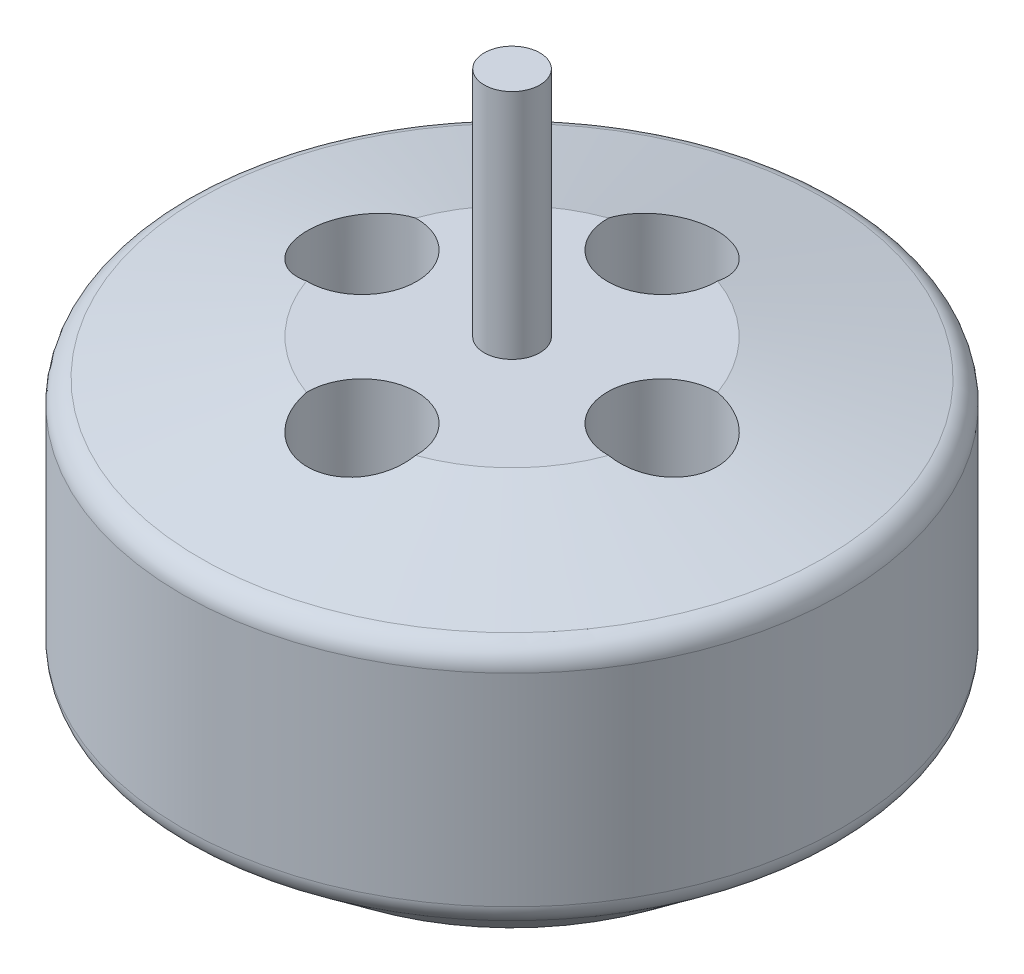
ISO-10303-21;
HEADER;
FILE_DESCRIPTION(('STEP AP214'),'2;1');
FILE_NAME('part.step','',(''),(''),'','','');
FILE_SCHEMA(('AUTOMOTIVE_DESIGN { 1 0 10303 214 1 1 1 1 }'));
ENDSEC;
DATA;
#1=APPLICATION_CONTEXT('core data for automotive mechanical design processes');
#2=APPLICATION_PROTOCOL_DEFINITION('international standard','automotive_design',2000,#1);
#3=PRODUCT_CONTEXT('',#1,'mechanical');
#4=PRODUCT('Part','Part','',(#3));
#5=PRODUCT_RELATED_PRODUCT_CATEGORY('part','',(#4));
#6=PRODUCT_DEFINITION_FORMATION('','',#4);
#7=PRODUCT_DEFINITION_CONTEXT('part definition',#1,'design');
#8=PRODUCT_DEFINITION('design','',#6,#7);
#9=PRODUCT_DEFINITION_SHAPE('','',#8);
#10=(LENGTH_UNIT() NAMED_UNIT(*) SI_UNIT(.MILLI.,.METRE.));
#11=(NAMED_UNIT(*) PLANE_ANGLE_UNIT() SI_UNIT($,.RADIAN.));
#12=(NAMED_UNIT(*) SI_UNIT($,.STERADIAN.) SOLID_ANGLE_UNIT());
#13=UNCERTAINTY_MEASURE_WITH_UNIT(LENGTH_MEASURE(1.E-05),#10,'distance_accuracy_value','');
#14=(GEOMETRIC_REPRESENTATION_CONTEXT(3) GLOBAL_UNCERTAINTY_ASSIGNED_CONTEXT((#13)) GLOBAL_UNIT_ASSIGNED_CONTEXT((#10,
#11,#12)) REPRESENTATION_CONTEXT('',''));
#15=CARTESIAN_POINT('',(0.,0.,0.));
#16=DIRECTION('',(0.,0.,1.));
#17=DIRECTION('',(1.,0.,0.));
#18=AXIS2_PLACEMENT_3D('',#15,#16,#17);
#19=CARTESIAN_POINT('',(-1.2,9.23124075479543,0.));
#20=DIRECTION('',(0.,-1.,0.));
#21=DIRECTION('',(-1.,0.,0.));
#22=AXIS2_PLACEMENT_3D('',#19,#20,#21);
#23=PLANE('',#22);
#24=CARTESIAN_POINT('',(0.,9.23124075479543,0.));
#25=DIRECTION('',(0.,-1.,0.));
#26=DIRECTION('',(1.,0.,0.));
#27=AXIS2_PLACEMENT_3D('',#24,#25,#26);
#28=CIRCLE('',#27,1.2);
#29=CARTESIAN_POINT('',(1.2,9.23124075479543,0.));
#30=VERTEX_POINT('',#29);
#31=EDGE_CURVE('E217',#30,#30,#28,.T.);
#32=ORIENTED_EDGE('',*,*,#31,.F.);
#33=EDGE_LOOP('',(#32));
#34=FACE_BOUND('',#33,.T.);
#35=ADVANCED_FACE('F37',(#34),#23,.F.);
#36=CARTESIAN_POINT('',(0.,-15.7687592452046,0.));
#37=DIRECTION('',(0.,1.,0.));
#38=DIRECTION('',(1.,0.,0.));
#39=AXIS2_PLACEMENT_3D('',#36,#37,#38);
#40=PLANE('',#39);
#41=CARTESIAN_POINT('',(0.,-15.7687592452046,0.));
#42=DIRECTION('',(0.,-1.,0.));
#43=DIRECTION('',(1.,0.,0.));
#44=AXIS2_PLACEMENT_3D('',#41,#42,#43);
#45=CIRCLE('',#44,10.);
#46=CARTESIAN_POINT('',(10.,-15.7687592452046,0.));
#47=VERTEX_POINT('',#46);
#48=EDGE_CURVE('E101',#47,#47,#45,.T.);
#49=ORIENTED_EDGE('',*,*,#48,.T.);
#50=EDGE_LOOP('',(#49));
#51=FACE_BOUND('',#50,.T.);
#52=ADVANCED_FACE('F124',(#51),#40,.F.);
#53=CARTESIAN_POINT('',(0.,-15.7687592452046,0.));
#54=DIRECTION('',(0.,1.,0.));
#55=DIRECTION('',(1.,0.,0.));
#56=AXIS2_PLACEMENT_3D('',#53,#54,#55);
#57=CONICAL_SURFACE('',#56,10.,0.91044247390561);
#58=CARTESIAN_POINT('',(0.,-12.79594785704,0.));
#59=DIRECTION('',(0.,1.,0.));
#60=DIRECTION('',(-1.,0.,0.));
#61=AXIS2_PLACEMENT_3D('',#58,#59,#60);
#62=CIRCLE('',#61,13.8276275638373);
#63=CARTESIAN_POINT('',(-13.8276275638373,-12.79594785704,0.));
#64=VERTEX_POINT('',#63);
#65=EDGE_CURVE('E45',#64,#64,#62,.T.);
#66=ORIENTED_EDGE('',*,*,#65,.F.);
#67=EDGE_LOOP('',(#66));
#68=FACE_BOUND('',#67,.T.);
#69=ORIENTED_EDGE('',*,*,#48,.F.);
#70=EDGE_LOOP('',(#69));
#71=FACE_BOUND('',#70,.T.);
#72=ADVANCED_FACE('F120',(#68,#71),#57,.T.);
#73=CARTESIAN_POINT('',(0.,9.23124075479543,0.));
#74=DIRECTION('',(0.,1.,0.));
#75=DIRECTION('',(1.,0.,0.));
#76=AXIS2_PLACEMENT_3D('',#73,#74,#75);
#77=CYLINDRICAL_SURFACE('',#76,14.2142312092208);
#78=CARTESIAN_POINT('',(0.,-12.0061726281659,0.));
#79=DIRECTION('',(0.,1.,0.));
#80=DIRECTION('',(-1.,0.,0.));
#81=AXIS2_PLACEMENT_3D('',#78,#79,#80);
#82=CIRCLE('',#81,14.2142312092208);
#83=CARTESIAN_POINT('',(-14.2142312092208,-12.0061726281659,0.));
#84=VERTEX_POINT('',#83);
#85=EDGE_CURVE('E112',#84,#84,#82,.F.);
#86=ORIENTED_EDGE('',*,*,#85,.F.);
#87=EDGE_LOOP('',(#86));
#88=FACE_BOUND('',#87,.T.);
#89=CARTESIAN_POINT('',(0.,-3.28649118160691,0.));
#90=DIRECTION('',(0.,1.,0.));
#91=DIRECTION('',(-1.,0.,0.));
#92=AXIS2_PLACEMENT_3D('',#89,#90,#91);
#93=CIRCLE('',#92,14.2142312092208);
#94=CARTESIAN_POINT('',(-14.2142312092208,-3.28649118160691,0.));
#95=VERTEX_POINT('',#94);
#96=EDGE_CURVE('E109',#95,#95,#93,.T.);
#97=ORIENTED_EDGE('',*,*,#96,.F.);
#98=EDGE_LOOP('',(#97));
#99=FACE_BOUND('',#98,.T.);
#100=ADVANCED_FACE('F123',(#88,#99),#77,.T.);
#101=CARTESIAN_POINT('',(0.,-2.4956836070486,0.));
#102=DIRECTION('',(0.,-1.,0.));
#103=DIRECTION('',(-1.,0.,0.));
#104=AXIS2_PLACEMENT_3D('',#101,#102,#103);
#105=CONICAL_SURFACE('',#104,14.2142312092208,1.33822123398075);
#106=CARTESIAN_POINT('',(0.,-2.31341507747465,0.));
#107=DIRECTION('',(0.,-1.,0.));
#108=DIRECTION('',(1.,0.,0.));
#109=AXIS2_PLACEMENT_3D('',#106,#107,#108);
#110=CIRCLE('',#109,13.4447152554514);
#111=CARTESIAN_POINT('',(13.4447152554514,-2.31341507747465,0.));
#112=VERTEX_POINT('',#111);
#113=EDGE_CURVE('E11',#112,#112,#110,.T.);
#114=ORIENTED_EDGE('',*,*,#113,.F.);
#115=EDGE_LOOP('',(#114));
#116=FACE_BOUND('',#115,.T.);
#117=CARTESIAN_POINT('',(0.,-0.768759245204573,0.));
#118=DIRECTION('',(0.,-1.,0.));
#119=DIRECTION('',(1.,0.,0.));
#120=AXIS2_PLACEMENT_3D('',#117,#118,#119);
#121=CIRCLE('',#120,6.92336289257609);
#122=CARTESIAN_POINT('',(-6.51163456727097,-0.768759245204573,-2.35192878391788));
#123=VERTEX_POINT('',#122);
#124=CARTESIAN_POINT('',(-2.35192878391786,-0.768759245204573,-6.51163456727098));
#125=VERTEX_POINT('',#124);
#126=EDGE_CURVE('E94',#123,#125,#121,.T.);
#127=ORIENTED_EDGE('',*,*,#126,.T.);
#128=CARTESIAN_POINT('',(2.35194444719155,-0.768559245204572,-6.51073113622684));
#129=CARTESIAN_POINT('',(2.35079951486763,-0.783332000693089,-6.57745570014126));
#130=CARTESIAN_POINT('',(2.3468148495238,-0.797896410721011,-6.64414594371815));
#131=CARTESIAN_POINT('',(2.3331753806295,-0.826556435951298,-6.77704791080669));
#132=CARTESIAN_POINT('',(2.32352035726234,-0.840652032957309,-6.84325961566662));
#133=CARTESIAN_POINT('',(2.28608604984194,-0.882131542247833,-7.04043922069013));
#134=CARTESIAN_POINT('',(2.24983548351799,-0.908734201870526,-7.17006979071748));
#135=CARTESIAN_POINT('',(2.15552952535401,-0.959348046210853,-7.42175242029026));
#136=CARTESIAN_POINT('',(2.09745478572055,-0.983356907059352,-7.54379764298049));
#137=CARTESIAN_POINT('',(1.96099362154542,-1.02836673670914,-7.77652527636077));
#138=CARTESIAN_POINT('',(1.88261634396142,-1.04936905345793,-7.88721277280558));
#139=CARTESIAN_POINT('',(1.70885134274288,-1.08777141214169,-8.09242117753742));
#140=CARTESIAN_POINT('',(1.61370670887936,-1.10521612446328,-8.18713958599771));
#141=CARTESIAN_POINT('',(1.40833474847906,-1.13658432289665,-8.35927102691238));
#142=CARTESIAN_POINT('',(1.29810575394333,-1.15050741910939,-8.43668214306363));
#143=CARTESIAN_POINT('',(1.06773986315709,-1.17440477346539,-8.57056019382037));
#144=CARTESIAN_POINT('',(0.947803860994439,-1.18444229161354,-8.62736161665646));
#145=CARTESIAN_POINT('',(0.699878812982873,-1.20074842149062,-8.72006108790814));
#146=CARTESIAN_POINT('',(0.571890974802832,-1.20701759693939,-8.75596226284118));
#147=CARTESIAN_POINT('',(0.313146809127141,-1.21564116706093,-8.80543268258466));
#148=CARTESIAN_POINT('',(0.182442409671641,-1.21804181398905,-8.81926575402207));
#149=CARTESIAN_POINT('',(-0.0794618033519385,-1.2190378623536,-8.82499935520962));
#150=CARTESIAN_POINT('',(-0.210661609241692,-1.21763332252701,-8.81690022350594));
#151=CARTESIAN_POINT('',(-0.469162967863131,-1.21105602525459,-8.77911478827728));
#152=CARTESIAN_POINT('',(-0.596480330548465,-1.20590156168721,-8.74953328702659));
#153=CARTESIAN_POINT('',(-0.844290066132515,-1.19192106622568,-8.66981159477425));
#154=CARTESIAN_POINT('',(-0.96478241314627,-1.18309502040753,-8.61967132580614));
#155=CARTESIAN_POINT('',(-1.1959654909996,-1.16186678381963,-8.50016504794808));
#156=CARTESIAN_POINT('',(-1.3066236474053,-1.1494532479475,-8.43073807407806));
#157=CARTESIAN_POINT('',(-1.51467821612674,-1.12124473587403,-8.2748224907063));
#158=CARTESIAN_POINT('',(-1.6120750068737,-1.10544985619708,-8.18833436824034));
#159=CARTESIAN_POINT('',(-1.79196666053313,-1.07053055319193,-7.99987320250691));
#160=CARTESIAN_POINT('',(-1.87429709211902,-1.05137340314538,-7.89774934702097));
#161=CARTESIAN_POINT('',(-2.02070362380709,-1.01012250688596,-7.68163142266156));
#162=CARTESIAN_POINT('',(-2.08477132307446,-0.988027416054875,-7.5676319238232));
#163=CARTESIAN_POINT('',(-2.1939390231126,-0.940863912960975,-7.3291244526911));
#164=CARTESIAN_POINT('',(-2.23870731925567,-0.915752318520396,-7.20447371298486));
#165=CARTESIAN_POINT('',(-2.30662848129602,-0.863284526982054,-6.95000958945557));
#166=CARTESIAN_POINT('',(-2.3298174371891,-0.835932161105562,-6.82020520532016));
#167=CARTESIAN_POINT('',(-2.34483315231518,-0.801282153219906,-6.65995368452851));
#168=CARTESIAN_POINT('',(-2.34705354010907,-0.794792532139538,-6.6301125755505));
#169=CARTESIAN_POINT('',(-2.35035172304497,-0.781735662258181,-6.57042820344878));
#170=CARTESIAN_POINT('',(-2.3514311174369,-0.775168535190601,-6.54058500212942));
#171=CARTESIAN_POINT('',(-2.35194444719155,-0.768559245204573,-6.51073113622684));
#172=B_SPLINE_CURVE_WITH_KNOTS('',3,(#128,#129,#130,#131,#132,#133,#134,#135,#136,#137,#138,
#139,#140,#141,#142,#143,#144,#145,#146,#147,#148,#149,#150,#151,#152,#153,#154,#155,#156,#157,
#158,#159,#160,#161,#162,#163,#164,#165,#166,#167,#168,#169,#170,#171),.UNSPECIFIED.,.F.,.F.,(4,
2,2,2,2,2,2,2,2,2,2,2,2,2,2,2,2,2,2,2,2,4),(0.,0.204927794866284,0.409863534472579,
0.819376483817851,1.22925333860041,1.63894585065763,2.0431254136225,2.44734970613807,
2.84468432539909,3.24195949115259,3.63444860507638,4.02693166056075,4.4175127315294,
4.80809528373992,5.19992679206895,5.59174711660468,5.98761729182822,6.38366927407366,
6.78628044099225,7.18821705127296,7.28006361052621,7.37178126354771),.UNSPECIFIED.);
#173=CARTESIAN_POINT('',(2.35192878391786,-0.768759245204573,-6.51163456727098));
#174=VERTEX_POINT('',#173);
#175=EDGE_CURVE('E89',#174,#125,#172,.T.);
#176=ORIENTED_EDGE('',*,*,#175,.F.);
#177=CARTESIAN_POINT('',(6.511634567271,-0.768759245204573,-2.35192878391779));
#178=VERTEX_POINT('',#177);
#179=EDGE_CURVE('E79',#174,#178,#121,.T.);
#180=ORIENTED_EDGE('',*,*,#179,.T.);
#181=CARTESIAN_POINT('',(6.51073113622682,-0.768559245204573,2.35194444719161));
#182=CARTESIAN_POINT('',(6.57745570014124,-0.78333200069309,2.3507995148677));
#183=CARTESIAN_POINT('',(6.64414594371812,-0.797896410721011,2.34681484952387));
#184=CARTESIAN_POINT('',(6.77704791080667,-0.826556435951298,2.33317538062957));
#185=CARTESIAN_POINT('',(6.8432596156666,-0.840652032957309,2.32352035726241));
#186=CARTESIAN_POINT('',(7.04043922069011,-0.882131542247833,2.28608604984201));
#187=CARTESIAN_POINT('',(7.17006979071745,-0.908734201870526,2.24983548351806));
#188=CARTESIAN_POINT('',(7.42175242029024,-0.959348046210854,2.15552952535409));
#189=CARTESIAN_POINT('',(7.54379764298046,-0.983356907059353,2.09745478572063));
#190=CARTESIAN_POINT('',(7.77652527636075,-1.02836673670914,1.96099362154551));
#191=CARTESIAN_POINT('',(7.88721277280556,-1.04936905345793,1.88261634396151));
#192=CARTESIAN_POINT('',(8.0924211775374,-1.08777141214169,1.70885134274297));
#193=CARTESIAN_POINT('',(8.18713958599769,-1.10521612446328,1.61370670887944));
#194=CARTESIAN_POINT('',(8.35927102691237,-1.13658432289665,1.40833474847915));
#195=CARTESIAN_POINT('',(8.43668214306362,-1.15050741910939,1.29810575394342));
#196=CARTESIAN_POINT('',(8.57056019382036,-1.17440477346539,1.06773986315718));
#197=CARTESIAN_POINT('',(8.62736161665645,-1.18444229161354,0.94780386099453));
#198=CARTESIAN_POINT('',(8.72006108790814,-1.20074842149062,0.699878812982966));
#199=CARTESIAN_POINT('',(8.75596226284117,-1.20701759693939,0.571890974802926));
#200=CARTESIAN_POINT('',(8.80543268258466,-1.21564116706093,0.313146809127235));
#201=CARTESIAN_POINT('',(8.81926575402206,-1.21804181398905,0.182442409671735));
#202=CARTESIAN_POINT('',(8.82499935520962,-1.2190378623536,-0.0794618033518449));
#203=CARTESIAN_POINT('',(8.81690022350594,-1.21763332252701,-0.210661609241598));
#204=CARTESIAN_POINT('',(8.77911478827728,-1.21105602525459,-0.469162967863038));
#205=CARTESIAN_POINT('',(8.74953328702659,-1.20590156168721,-0.596480330548372));
#206=CARTESIAN_POINT('',(8.66981159477426,-1.19192106622568,-0.844290066132423));
#207=CARTESIAN_POINT('',(8.61967132580615,-1.18309502040753,-0.964782413146178));
#208=CARTESIAN_POINT('',(8.50016504794809,-1.16186678381963,-1.19596549099951));
#209=CARTESIAN_POINT('',(8.43073807407808,-1.1494532479475,-1.30662364740521));
#210=CARTESIAN_POINT('',(8.27482249070632,-1.12124473587403,-1.51467821612665));
#211=CARTESIAN_POINT('',(8.18833436824036,-1.10544985619708,-1.61207500687362));
#212=CARTESIAN_POINT('',(7.99987320250693,-1.07053055319193,-1.79196666053305));
#213=CARTESIAN_POINT('',(7.89774934702099,-1.05137340314538,-1.87429709211894));
#214=CARTESIAN_POINT('',(7.68163142266158,-1.01012250688596,-2.02070362380701));
#215=CARTESIAN_POINT('',(7.56763192382322,-0.988027416054875,-2.08477132307438));
#216=CARTESIAN_POINT('',(7.32912445269113,-0.940863912960975,-2.19393902311252));
#217=CARTESIAN_POINT('',(7.20447371298488,-0.915752318520397,-2.23870731925559));
#218=CARTESIAN_POINT('',(6.95000958945559,-0.863284526982055,-2.30662848129594));
#219=CARTESIAN_POINT('',(6.82020520532018,-0.835932161105561,-2.32981743718902));
#220=CARTESIAN_POINT('',(6.65995368452854,-0.801282153219907,-2.3448331523151));
#221=CARTESIAN_POINT('',(6.63011257555052,-0.794792532139538,-2.347053540109));
#222=CARTESIAN_POINT('',(6.57042820344881,-0.781735662258181,-2.3503517230449));
#223=CARTESIAN_POINT('',(6.54058500212944,-0.775168535190601,-2.35143111743683));
#224=CARTESIAN_POINT('',(6.51073113622687,-0.768559245204573,-2.35194444719148));
#225=B_SPLINE_CURVE_WITH_KNOTS('',3,(#181,#182,#183,#184,#185,#186,#187,#188,#189,#190,#191,
#192,#193,#194,#195,#196,#197,#198,#199,#200,#201,#202,#203,#204,#205,#206,#207,#208,#209,#210,
#211,#212,#213,#214,#215,#216,#217,#218,#219,#220,#221,#222,#223,#224),.UNSPECIFIED.,.F.,.F.,(4,
2,2,2,2,2,2,2,2,2,2,2,2,2,2,2,2,2,2,2,2,4),(0.,0.204927794866283,0.409863534472579,
0.819376483817849,1.22925333860041,1.63894585065763,2.0431254136225,2.44734970613807,
2.84468432539909,3.24195949115259,3.63444860507638,4.02693166056075,4.4175127315294,
4.80809528373992,5.19992679206895,5.59174711660468,5.98761729182822,6.38366927407366,
6.78628044099226,7.18821705127296,7.28006361052621,7.37178126354771),.UNSPECIFIED.);
#226=CARTESIAN_POINT('',(6.51163456727096,-0.768759245204573,2.35192878391792));
#227=VERTEX_POINT('',#226);
#228=EDGE_CURVE('E86',#227,#178,#225,.T.);
#229=ORIENTED_EDGE('',*,*,#228,.F.);
#230=CARTESIAN_POINT('',(2.35192878391786,-0.768759245204573,6.51163456727098));
#231=VERTEX_POINT('',#230);
#232=EDGE_CURVE('E82',#227,#231,#121,.T.);
#233=ORIENTED_EDGE('',*,*,#232,.T.);
#234=CARTESIAN_POINT('',(-2.35194444719155,-0.768559245204572,6.51073113622684));
#235=CARTESIAN_POINT('',(-2.35079951486763,-0.783332000693089,6.57745570014126));
#236=CARTESIAN_POINT('',(-2.3468148495238,-0.797896410721011,6.64414594371815));
#237=CARTESIAN_POINT('',(-2.3331753806295,-0.826556435951298,6.77704791080669));
#238=CARTESIAN_POINT('',(-2.32352035726234,-0.840652032957309,6.84325961566662));
#239=CARTESIAN_POINT('',(-2.28608604984194,-0.882131542247833,7.04043922069013));
#240=CARTESIAN_POINT('',(-2.24983548351799,-0.908734201870526,7.17006979071748));
#241=CARTESIAN_POINT('',(-2.15552952535401,-0.959348046210853,7.42175242029026));
#242=CARTESIAN_POINT('',(-2.09745478572055,-0.983356907059353,7.54379764298049));
#243=CARTESIAN_POINT('',(-1.96099362154542,-1.02836673670914,7.77652527636077));
#244=CARTESIAN_POINT('',(-1.88261634396142,-1.04936905345793,7.88721277280558));
#245=CARTESIAN_POINT('',(-1.70885134274288,-1.08777141214169,8.09242117753742));
#246=CARTESIAN_POINT('',(-1.61370670887936,-1.10521612446328,8.18713958599771));
#247=CARTESIAN_POINT('',(-1.40833474847906,-1.13658432289665,8.35927102691238));
#248=CARTESIAN_POINT('',(-1.29810575394333,-1.15050741910939,8.43668214306363));
#249=CARTESIAN_POINT('',(-1.06773986315709,-1.17440477346539,8.57056019382037));
#250=CARTESIAN_POINT('',(-0.94780386099444,-1.18444229161354,8.62736161665646));
#251=CARTESIAN_POINT('',(-0.699878812982874,-1.20074842149062,8.72006108790814));
#252=CARTESIAN_POINT('',(-0.571890974802832,-1.20701759693939,8.75596226284118));
#253=CARTESIAN_POINT('',(-0.313146809127141,-1.21564116706093,8.80543268258466));
#254=CARTESIAN_POINT('',(-0.182442409671641,-1.21804181398905,8.81926575402207));
#255=CARTESIAN_POINT('',(0.0794618033519384,-1.2190378623536,8.82499935520962));
#256=CARTESIAN_POINT('',(0.210661609241692,-1.21763332252701,8.81690022350594));
#257=CARTESIAN_POINT('',(0.469162967863131,-1.21105602525459,8.77911478827728));
#258=CARTESIAN_POINT('',(0.596480330548465,-1.20590156168721,8.74953328702659));
#259=CARTESIAN_POINT('',(0.844290066132515,-1.19192106622568,8.66981159477425));
#260=CARTESIAN_POINT('',(0.96478241314627,-1.18309502040753,8.61967132580614));
#261=CARTESIAN_POINT('',(1.1959654909996,-1.16186678381963,8.50016504794808));
#262=CARTESIAN_POINT('',(1.3066236474053,-1.1494532479475,8.43073807407806));
#263=CARTESIAN_POINT('',(1.51467821612674,-1.12124473587403,8.2748224907063));
#264=CARTESIAN_POINT('',(1.6120750068737,-1.10544985619708,8.18833436824034));
#265=CARTESIAN_POINT('',(1.79196666053313,-1.07053055319193,7.99987320250691));
#266=CARTESIAN_POINT('',(1.87429709211902,-1.05137340314538,7.89774934702097));
#267=CARTESIAN_POINT('',(2.02070362380709,-1.01012250688596,7.68163142266156));
#268=CARTESIAN_POINT('',(2.08477132307446,-0.988027416054875,7.5676319238232));
#269=CARTESIAN_POINT('',(2.1939390231126,-0.940863912960975,7.32912445269111));
#270=CARTESIAN_POINT('',(2.23870731925567,-0.915752318520396,7.20447371298486));
#271=CARTESIAN_POINT('',(2.30662848129602,-0.863284526982055,6.95000958945557));
#272=CARTESIAN_POINT('',(2.3298174371891,-0.835932161105563,6.82020520532016));
#273=CARTESIAN_POINT('',(2.34483315231518,-0.801282153219907,6.65995368452851));
#274=CARTESIAN_POINT('',(2.34705354010907,-0.794792532139538,6.6301125755505));
#275=CARTESIAN_POINT('',(2.35035172304497,-0.781735662258181,6.57042820344878));
#276=CARTESIAN_POINT('',(2.3514311174369,-0.775168535190601,6.54058500212942));
#277=CARTESIAN_POINT('',(2.35194444719155,-0.768559245204573,6.51073113622684));
#278=B_SPLINE_CURVE_WITH_KNOTS('',3,(#234,#235,#236,#237,#238,#239,#240,#241,#242,#243,#244,
#245,#246,#247,#248,#249,#250,#251,#252,#253,#254,#255,#256,#257,#258,#259,#260,#261,#262,#263,
#264,#265,#266,#267,#268,#269,#270,#271,#272,#273,#274,#275,#276,#277),.UNSPECIFIED.,.F.,.F.,(4,
2,2,2,2,2,2,2,2,2,2,2,2,2,2,2,2,2,2,2,2,4),(0.,0.204927794866284,0.409863534472579,
0.819376483817851,1.22925333860041,1.63894585065763,2.0431254136225,2.44734970613807,
2.84468432539909,3.24195949115259,3.63444860507638,4.02693166056075,4.4175127315294,
4.80809528373992,5.19992679206896,5.59174711660468,5.98761729182822,6.38366927407366,
6.78628044099226,7.18821705127296,7.28006361052621,7.37178126354771),.UNSPECIFIED.);
#279=CARTESIAN_POINT('',(-2.35192878391786,-0.768759245204573,6.51163456727098));
#280=VERTEX_POINT('',#279);
#281=EDGE_CURVE('E179',#280,#231,#278,.T.);
#282=ORIENTED_EDGE('',*,*,#281,.F.);
#283=CARTESIAN_POINT('',(-6.51163456727099,-0.768759245204573,2.35192878391783));
#284=VERTEX_POINT('',#283);
#285=EDGE_CURVE('E96',#280,#284,#121,.T.);
#286=ORIENTED_EDGE('',*,*,#285,.T.);
#287=CARTESIAN_POINT('',(-6.51073113622683,-0.768559245204572,-2.35194444719157));
#288=CARTESIAN_POINT('',(-6.57745570014125,-0.783332000693089,-2.35079951486765));
#289=CARTESIAN_POINT('',(-6.64414594371814,-0.797896410721011,-2.34681484952383));
#290=CARTESIAN_POINT('',(-6.77704791080668,-0.826556435951298,-2.33317538062952));
#291=CARTESIAN_POINT('',(-6.84325961566661,-0.840652032957309,-2.32352035726236));
#292=CARTESIAN_POINT('',(-7.04043922069012,-0.882131542247833,-2.28608604984196));
#293=CARTESIAN_POINT('',(-7.17006979071747,-0.908734201870526,-2.24983548351801));
#294=CARTESIAN_POINT('',(-7.42175242029025,-0.959348046210853,-2.15552952535404));
#295=CARTESIAN_POINT('',(-7.54379764298048,-0.983356907059352,-2.09745478572058));
#296=CARTESIAN_POINT('',(-7.77652527636077,-1.02836673670914,-1.96099362154545));
#297=CARTESIAN_POINT('',(-7.88721277280557,-1.04936905345793,-1.88261634396145));
#298=CARTESIAN_POINT('',(-8.09242117753741,-1.08777141214169,-1.70885134274292));
#299=CARTESIAN_POINT('',(-8.1871395859977,-1.10521612446328,-1.61370670887939));
#300=CARTESIAN_POINT('',(-8.35927102691237,-1.13658432289664,-1.40833474847909));
#301=CARTESIAN_POINT('',(-8.43668214306363,-1.15050741910939,-1.29810575394336));
#302=CARTESIAN_POINT('',(-8.57056019382037,-1.17440477346539,-1.06773986315712));
#303=CARTESIAN_POINT('',(-8.62736161665646,-1.18444229161354,-0.947803860994472));
#304=CARTESIAN_POINT('',(-8.72006108790814,-1.20074842149062,-0.699878812982907));
#305=CARTESIAN_POINT('',(-8.75596226284117,-1.20701759693939,-0.571890974802866));
#306=CARTESIAN_POINT('',(-8.80543268258466,-1.21564116706093,-0.313146809127175));
#307=CARTESIAN_POINT('',(-8.81926575402206,-1.21804181398905,-0.182442409671675));
#308=CARTESIAN_POINT('',(-8.82499935520962,-1.2190378623536,0.079461803351905));
#309=CARTESIAN_POINT('',(-8.81690022350594,-1.21763332252701,0.210661609241658));
#310=CARTESIAN_POINT('',(-8.77911478827728,-1.21105602525459,0.469162967863097));
#311=CARTESIAN_POINT('',(-8.74953328702659,-1.20590156168721,0.596480330548431));
#312=CARTESIAN_POINT('',(-8.66981159477426,-1.19192106622568,0.844290066132482));
#313=CARTESIAN_POINT('',(-8.61967132580615,-1.18309502040753,0.964782413146237));
#314=CARTESIAN_POINT('',(-8.50016504794809,-1.16186678381963,1.19596549099957));
#315=CARTESIAN_POINT('',(-8.43073807407807,-1.1494532479475,1.30662364740527));
#316=CARTESIAN_POINT('',(-8.27482249070631,-1.12124473587403,1.51467821612671));
#317=CARTESIAN_POINT('',(-8.18833436824035,-1.10544985619708,1.61207500687367));
#318=CARTESIAN_POINT('',(-7.99987320250692,-1.07053055319193,1.7919666605331));
#319=CARTESIAN_POINT('',(-7.89774934702098,-1.05137340314538,1.87429709211899));
#320=CARTESIAN_POINT('',(-7.68163142266157,-1.01012250688596,2.02070362380707));
#321=CARTESIAN_POINT('',(-7.5676319238232,-0.988027416054875,2.08477132307443));
#322=CARTESIAN_POINT('',(-7.32912445269111,-0.940863912960976,2.19393902311257));
#323=CARTESIAN_POINT('',(-7.20447371298487,-0.915752318520397,2.23870731925564));
#324=CARTESIAN_POINT('',(-6.95000958945558,-0.863284526982055,2.30662848129599));
#325=CARTESIAN_POINT('',(-6.82020520532017,-0.835932161105562,2.32981743718907));
#326=CARTESIAN_POINT('',(-6.65995368452852,-0.801282153219907,2.34483315231515));
#327=CARTESIAN_POINT('',(-6.63011257555051,-0.794792532139539,2.34705354010905));
#328=CARTESIAN_POINT('',(-6.57042820344879,-0.781735662258181,2.35035172304495));
#329=CARTESIAN_POINT('',(-6.54058500212942,-0.775168535190601,2.35143111743687));
#330=CARTESIAN_POINT('',(-6.51073113622685,-0.768559245204573,2.35194444719153));
#331=B_SPLINE_CURVE_WITH_KNOTS('',3,(#287,#288,#289,#290,#291,#292,#293,#294,#295,#296,#297,
#298,#299,#300,#301,#302,#303,#304,#305,#306,#307,#308,#309,#310,#311,#312,#313,#314,#315,#316,
#317,#318,#319,#320,#321,#322,#323,#324,#325,#326,#327,#328,#329,#330),.UNSPECIFIED.,.F.,.F.,(4,
2,2,2,2,2,2,2,2,2,2,2,2,2,2,2,2,2,2,2,2,4),(0.,0.204927794866284,0.409863534472579,
0.819376483817849,1.22925333860041,1.63894585065763,2.0431254136225,2.44734970613807,
2.84468432539909,3.24195949115259,3.63444860507638,4.02693166056075,4.41751273152939,
4.80809528373992,5.19992679206895,5.59174711660468,5.98761729182822,6.38366927407366,
6.78628044099226,7.18821705127296,7.28006361052621,7.37178126354771),.UNSPECIFIED.);
#332=EDGE_CURVE('E157',#123,#284,#331,.T.);
#333=ORIENTED_EDGE('',*,*,#332,.F.);
#334=EDGE_LOOP('',(#127,#176,#180,#229,#233,#282,#286,#333));
#335=FACE_BOUND('',#334,.T.);
#336=ADVANCED_FACE('F93',(#116,#335),#105,.T.);
#337=CARTESIAN_POINT('',(-1.2,-0.768759245204573,0.));
#338=DIRECTION('',(0.,-1.,0.));
#339=DIRECTION('',(-1.,0.,0.));
#340=AXIS2_PLACEMENT_3D('',#337,#338,#339);
#341=PLANE('',#340);
#342=CARTESIAN_POINT('',(0.,-0.768759245204573,0.));
#343=DIRECTION('',(0.,-1.,0.));
#344=DIRECTION('',(1.,0.,0.));
#345=AXIS2_PLACEMENT_3D('',#342,#343,#344);
#346=CIRCLE('',#345,1.2);
#347=CARTESIAN_POINT('',(1.2,-0.768759245204573,0.));
#348=VERTEX_POINT('',#347);
#349=EDGE_CURVE('E97',#348,#348,#346,.T.);
#350=ORIENTED_EDGE('',*,*,#349,.T.);
#351=EDGE_LOOP('',(#350));
#352=FACE_BOUND('',#351,.T.);
#353=ORIENTED_EDGE('',*,*,#285,.F.);
#354=CARTESIAN_POINT('',(0.,-0.768759245204573,6.47040605185298));
#355=DIRECTION('',(0.,1.,0.));
#356=DIRECTION('',(-1.,0.,0.));
#357=AXIS2_PLACEMENT_3D('',#354,#355,#356);
#358=CIRCLE('',#357,2.35229011712095);
#359=EDGE_CURVE('E84',#231,#280,#358,.T.);
#360=ORIENTED_EDGE('',*,*,#359,.F.);
#361=ORIENTED_EDGE('',*,*,#232,.F.);
#362=CARTESIAN_POINT('',(6.47040605185298,-0.768759245204573,0.));
#363=DIRECTION('',(0.,1.,0.));
#364=DIRECTION('',(-1.,0.,0.));
#365=AXIS2_PLACEMENT_3D('',#362,#363,#364);
#366=CIRCLE('',#365,2.35229011712095);
#367=EDGE_CURVE('E51',#178,#227,#366,.T.);
#368=ORIENTED_EDGE('',*,*,#367,.F.);
#369=ORIENTED_EDGE('',*,*,#179,.F.);
#370=CARTESIAN_POINT('',(0.,-0.768759245204573,-6.47040605185298));
#371=DIRECTION('',(0.,1.,0.));
#372=DIRECTION('',(-1.,0.,0.));
#373=AXIS2_PLACEMENT_3D('',#370,#371,#372);
#374=CIRCLE('',#373,2.35229011712095);
#375=EDGE_CURVE('E58',#125,#174,#374,.T.);
#376=ORIENTED_EDGE('',*,*,#375,.F.);
#377=ORIENTED_EDGE('',*,*,#126,.F.);
#378=CARTESIAN_POINT('',(-6.47040605185298,-0.768759245204573,0.));
#379=DIRECTION('',(0.,1.,0.));
#380=DIRECTION('',(-1.,0.,0.));
#381=AXIS2_PLACEMENT_3D('',#378,#379,#380);
#382=CIRCLE('',#381,2.35229011712095);
#383=EDGE_CURVE('E107',#284,#123,#382,.T.);
#384=ORIENTED_EDGE('',*,*,#383,.F.);
#385=EDGE_LOOP('',(#353,#360,#361,#368,#369,#376,#377,#384));
#386=FACE_BOUND('',#385,.T.);
#387=ADVANCED_FACE('F77',(#352,#386),#341,.F.);
#388=CARTESIAN_POINT('',(0.,9.23124075479543,0.));
#389=DIRECTION('',(0.,1.,0.));
#390=DIRECTION('',(1.,0.,0.));
#391=AXIS2_PLACEMENT_3D('',#388,#389,#390);
#392=CYLINDRICAL_SURFACE('',#391,1.2);
#393=ORIENTED_EDGE('',*,*,#31,.T.);
#394=EDGE_LOOP('',(#393));
#395=FACE_BOUND('',#394,.T.);
#396=ORIENTED_EDGE('',*,*,#349,.F.);
#397=EDGE_LOOP('',(#396));
#398=FACE_BOUND('',#397,.T.);
#399=ADVANCED_FACE('F206',(#395,#398),#392,.T.);
#400=CARTESIAN_POINT('',(0.,-5.38437962260229,6.47040605185298));
#401=DIRECTION('',(0.,1.,0.));
#402=DIRECTION('',(1.,0.,0.));
#403=AXIS2_PLACEMENT_3D('',#400,#401,#402);
#404=CYLINDRICAL_SURFACE('',#403,2.35229011712095);
#405=CARTESIAN_POINT('',(0.,-5.38437962260229,6.47040605185298));
#406=DIRECTION('',(0.,-1.,0.));
#407=DIRECTION('',(1.,0.,0.));
#408=AXIS2_PLACEMENT_3D('',#405,#406,#407);
#409=CIRCLE('',#408,2.35229011712095);
#410=CARTESIAN_POINT('',(2.35229011712095,-5.38437962260229,6.47040605185298));
#411=VERTEX_POINT('',#410);
#412=EDGE_CURVE('E166',#411,#411,#409,.T.);
#413=ORIENTED_EDGE('',*,*,#412,.T.);
#414=EDGE_LOOP('',(#413));
#415=FACE_BOUND('',#414,.T.);
#416=ORIENTED_EDGE('',*,*,#359,.T.);
#417=ORIENTED_EDGE('',*,*,#281,.T.);
#418=EDGE_LOOP('',(#416,#417));
#419=FACE_BOUND('',#418,.T.);
#420=ADVANCED_FACE('F202',(#415,#419),#404,.F.);
#421=CARTESIAN_POINT('',(0.,-5.38437962260229,6.47040605185298));
#422=DIRECTION('',(0.,1.,0.));
#423=DIRECTION('',(1.,0.,0.));
#424=AXIS2_PLACEMENT_3D('',#421,#422,#423);
#425=PLANE('',#424);
#426=ORIENTED_EDGE('',*,*,#412,.F.);
#427=EDGE_LOOP('',(#426));
#428=FACE_BOUND('',#427,.T.);
#429=ADVANCED_FACE('F199',(#428),#425,.T.);
#430=CARTESIAN_POINT('',(6.47040605185298,-5.38437962260229,0.));
#431=DIRECTION('',(0.,1.,0.));
#432=DIRECTION('',(1.,0.,0.));
#433=AXIS2_PLACEMENT_3D('',#430,#431,#432);
#434=CYLINDRICAL_SURFACE('',#433,2.35229011712095);
#435=CARTESIAN_POINT('',(6.47040605185298,-5.38437962260229,0.));
#436=DIRECTION('',(0.,-1.,0.));
#437=DIRECTION('',(0.,0.,-1.));
#438=AXIS2_PLACEMENT_3D('',#435,#436,#437);
#439=CIRCLE('',#438,2.35229011712095);
#440=CARTESIAN_POINT('',(6.47040605185301,-5.38437962260229,-2.35229011712088));
#441=VERTEX_POINT('',#440);
#442=EDGE_CURVE('E192',#441,#441,#439,.T.);
#443=ORIENTED_EDGE('',*,*,#442,.T.);
#444=EDGE_LOOP('',(#443));
#445=FACE_BOUND('',#444,.T.);
#446=ORIENTED_EDGE('',*,*,#367,.T.);
#447=ORIENTED_EDGE('',*,*,#228,.T.);
#448=EDGE_LOOP('',(#446,#447));
#449=FACE_BOUND('',#448,.T.);
#450=ADVANCED_FACE('F87',(#445,#449),#434,.F.);
#451=CARTESIAN_POINT('',(6.47040605185298,-5.38437962260229,0.));
#452=DIRECTION('',(0.,1.,0.));
#453=DIRECTION('',(0.,0.,-1.));
#454=AXIS2_PLACEMENT_3D('',#451,#452,#453);
#455=PLANE('',#454);
#456=ORIENTED_EDGE('',*,*,#442,.F.);
#457=EDGE_LOOP('',(#456));
#458=FACE_BOUND('',#457,.T.);
#459=ADVANCED_FACE('F198',(#458),#455,.T.);
#460=CARTESIAN_POINT('',(0.,-5.38437962260229,-6.47040605185298));
#461=DIRECTION('',(0.,1.,0.));
#462=DIRECTION('',(1.,0.,0.));
#463=AXIS2_PLACEMENT_3D('',#460,#461,#462);
#464=CYLINDRICAL_SURFACE('',#463,2.35229011712095);
#465=CARTESIAN_POINT('',(0.,-5.38437962260229,-6.47040605185298));
#466=DIRECTION('',(0.,-1.,0.));
#467=DIRECTION('',(-1.,0.,0.));
#468=AXIS2_PLACEMENT_3D('',#465,#466,#467);
#469=CIRCLE('',#468,2.35229011712095);
#470=CARTESIAN_POINT('',(-2.35229011712095,-5.38437962260229,-6.47040605185298));
#471=VERTEX_POINT('',#470);
#472=EDGE_CURVE('E240',#471,#471,#469,.T.);
#473=ORIENTED_EDGE('',*,*,#472,.T.);
#474=EDGE_LOOP('',(#473));
#475=FACE_BOUND('',#474,.T.);
#476=ORIENTED_EDGE('',*,*,#375,.T.);
#477=ORIENTED_EDGE('',*,*,#175,.T.);
#478=EDGE_LOOP('',(#476,#477));
#479=FACE_BOUND('',#478,.T.);
#480=ADVANCED_FACE('F228',(#475,#479),#464,.F.);
#481=CARTESIAN_POINT('',(0.,-5.38437962260229,-6.47040605185298));
#482=DIRECTION('',(0.,1.,0.));
#483=DIRECTION('',(-1.,0.,0.));
#484=AXIS2_PLACEMENT_3D('',#481,#482,#483);
#485=PLANE('',#484);
#486=ORIENTED_EDGE('',*,*,#472,.F.);
#487=EDGE_LOOP('',(#486));
#488=FACE_BOUND('',#487,.T.);
#489=ADVANCED_FACE('F149',(#488),#485,.T.);
#490=CARTESIAN_POINT('',(-6.47040605185298,-5.38437962260229,0.));
#491=DIRECTION('',(0.,1.,0.));
#492=DIRECTION('',(1.,0.,0.));
#493=AXIS2_PLACEMENT_3D('',#490,#491,#492);
#494=CYLINDRICAL_SURFACE('',#493,2.35229011712095);
#495=CARTESIAN_POINT('',(-6.47040605185298,-5.38437962260229,0.));
#496=DIRECTION('',(0.,-1.,0.));
#497=DIRECTION('',(0.,0.,1.));
#498=AXIS2_PLACEMENT_3D('',#495,#496,#497);
#499=CIRCLE('',#498,2.35229011712095);
#500=CARTESIAN_POINT('',(-6.47040605185299,-5.38437962260229,2.35229011712093));
#501=VERTEX_POINT('',#500);
#502=EDGE_CURVE('E90',#501,#501,#499,.T.);
#503=ORIENTED_EDGE('',*,*,#502,.T.);
#504=EDGE_LOOP('',(#503));
#505=FACE_BOUND('',#504,.T.);
#506=ORIENTED_EDGE('',*,*,#383,.T.);
#507=ORIENTED_EDGE('',*,*,#332,.T.);
#508=EDGE_LOOP('',(#506,#507));
#509=FACE_BOUND('',#508,.T.);
#510=ADVANCED_FACE('F143',(#505,#509),#494,.F.);
#511=CARTESIAN_POINT('',(-6.47040605185298,-5.38437962260229,0.));
#512=DIRECTION('',(0.,1.,0.));
#513=DIRECTION('',(0.,0.,1.));
#514=AXIS2_PLACEMENT_3D('',#511,#512,#513);
#515=PLANE('',#514);
#516=ORIENTED_EDGE('',*,*,#502,.F.);
#517=EDGE_LOOP('',(#516));
#518=FACE_BOUND('',#517,.T.);
#519=ADVANCED_FACE('F137',(#518),#515,.T.);
#520=CARTESIAN_POINT('',(0.,-12.0061726281659,0.));
#521=DIRECTION('',(0.,-1.,0.));
#522=DIRECTION('',(-1.,0.,0.));
#523=AXIS2_PLACEMENT_3D('',#520,#521,#522);
#524=TOROIDAL_SURFACE('',#523,13.2142312092208,1.);
#525=ORIENTED_EDGE('',*,*,#65,.T.);
#526=EDGE_LOOP('',(#525));
#527=FACE_BOUND('',#526,.T.);
#528=ORIENTED_EDGE('',*,*,#85,.T.);
#529=EDGE_LOOP('',(#528));
#530=FACE_BOUND('',#529,.T.);
#531=ADVANCED_FACE('F117',(#527,#530),#524,.T.);
#532=CARTESIAN_POINT('',(0.,-3.2864911816069,0.));
#533=DIRECTION('',(0.,-1.,0.));
#534=DIRECTION('',(-1.,0.,0.));
#535=AXIS2_PLACEMENT_3D('',#532,#533,#534);
#536=TOROIDAL_SURFACE('',#535,13.2142312092208,1.);
#537=ORIENTED_EDGE('',*,*,#96,.T.);
#538=EDGE_LOOP('',(#537));
#539=FACE_BOUND('',#538,.T.);
#540=ORIENTED_EDGE('',*,*,#113,.T.);
#541=EDGE_LOOP('',(#540));
#542=FACE_BOUND('',#541,.T.);
#543=ADVANCED_FACE('F39',(#539,#542),#536,.T.);
#544=CLOSED_SHELL('',(#35,#52,#72,#100,#336,#387,#399,#420,#429,#450,#459,#480,#489,#510,#519,
#531,#543));
#545=MANIFOLD_SOLID_BREP('B2',#544);
#546=ADVANCED_BREP_SHAPE_REPRESENTATION('',(#18,#545),#14);
#547=SHAPE_DEFINITION_REPRESENTATION(#9,#546);
ENDSEC;
END-ISO-10303-21;
